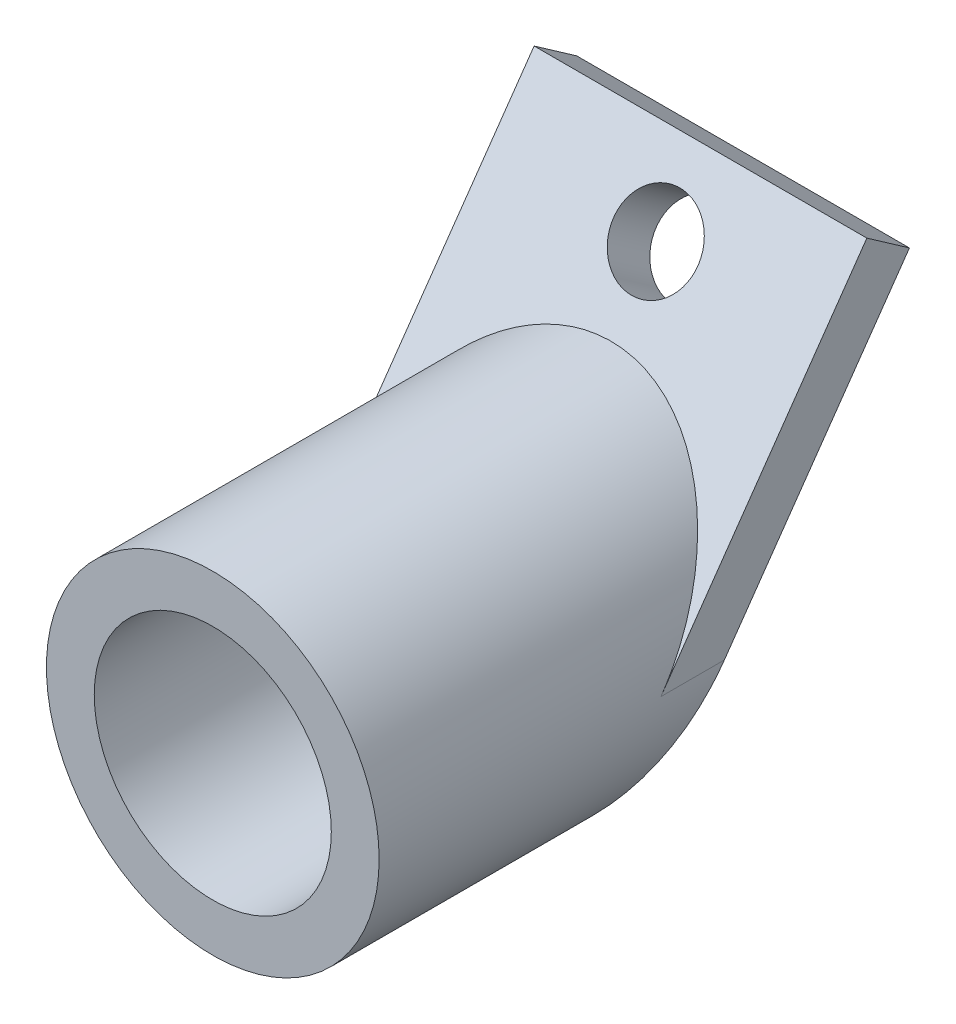
ISO-10303-21;
HEADER;
FILE_DESCRIPTION(('STEP AP214'),'2;1');
FILE_NAME('part.step','',(''),(''),'','','');
FILE_SCHEMA(('AUTOMOTIVE_DESIGN { 1 0 10303 214 1 1 1 1 }'));
ENDSEC;
DATA;
#1=APPLICATION_CONTEXT('core data for automotive mechanical design processes');
#2=APPLICATION_PROTOCOL_DEFINITION('international standard','automotive_design',2000,#1);
#3=PRODUCT_CONTEXT('',#1,'mechanical');
#4=PRODUCT('Part','Part','',(#3));
#5=PRODUCT_RELATED_PRODUCT_CATEGORY('part','',(#4));
#6=PRODUCT_DEFINITION_FORMATION('','',#4);
#7=PRODUCT_DEFINITION_CONTEXT('part definition',#1,'design');
#8=PRODUCT_DEFINITION('design','',#6,#7);
#9=PRODUCT_DEFINITION_SHAPE('','',#8);
#10=(LENGTH_UNIT() NAMED_UNIT(*) SI_UNIT(.MILLI.,.METRE.));
#11=(NAMED_UNIT(*) PLANE_ANGLE_UNIT() SI_UNIT($,.RADIAN.));
#12=(NAMED_UNIT(*) SI_UNIT($,.STERADIAN.) SOLID_ANGLE_UNIT());
#13=UNCERTAINTY_MEASURE_WITH_UNIT(LENGTH_MEASURE(1.E-05),#10,'distance_accuracy_value','');
#14=(GEOMETRIC_REPRESENTATION_CONTEXT(3) GLOBAL_UNCERTAINTY_ASSIGNED_CONTEXT((#13)) GLOBAL_UNIT_ASSIGNED_CONTEXT((#10,
#11,#12)) REPRESENTATION_CONTEXT('',''));
#15=CARTESIAN_POINT('',(0.,0.,0.));
#16=DIRECTION('',(0.,0.,1.));
#17=DIRECTION('',(1.,0.,0.));
#18=AXIS2_PLACEMENT_3D('',#15,#16,#17);
#19=CARTESIAN_POINT('',(16.,16.,-18.3027682789034));
#20=DIRECTION('',(0.,-0.573576436351044,-0.819152044288993));
#21=DIRECTION('',(0.,0.819152044288993,-0.573576436351044));
#22=AXIS2_PLACEMENT_3D('',#19,#20,#21);
#23=PLANE('',#22);
#24=CARTESIAN_POINT('',(0.,22.1436403321675,-22.6045915515363));
#25=DIRECTION('',(0.,0.573576436351044,0.819152044288993));
#26=DIRECTION('',(0.,-0.819152044288993,0.573576436351044));
#27=AXIS2_PLACEMENT_3D('',#24,#25,#26);
#28=CIRCLE('',#27,4.05);
#29=CARTESIAN_POINT('',(0.,18.826074552797,-20.2816069843145));
#30=VERTEX_POINT('',#29);
#31=EDGE_CURVE('E234',#30,#30,#28,.T.);
#32=ORIENTED_EDGE('',*,*,#31,.F.);
#33=EDGE_LOOP('',(#32));
#34=FACE_BOUND('',#33,.T.);
#35=CARTESIAN_POINT('',(0.,0.,-7.09944766754814));
#36=DIRECTION('',(0.,-0.573576436351044,-0.819152044288993));
#37=DIRECTION('',(0.,-0.819152044288993,0.573576436351044));
#38=AXIS2_PLACEMENT_3D('',#35,#36,#37);
#39=ELLIPSE('',#38,19.5323934201833,16.);
#40=CARTESIAN_POINT('',(16.,0.,-7.09944766754815));
#41=VERTEX_POINT('',#40);
#42=CARTESIAN_POINT('',(-16.,0.,-7.09944766754815));
#43=VERTEX_POINT('',#42);
#44=EDGE_CURVE('E83',#41,#43,#39,.F.);
#45=ORIENTED_EDGE('',*,*,#44,.F.);
#46=DIRECTION('',(0.,-0.819152044288994,0.573576436351043));
#47=VECTOR('',#46,1.);
#48=CARTESIAN_POINT('',(16.,16.,-18.3027682789034));
#49=LINE('',#48,#47);
#50=CARTESIAN_POINT('',(16.,28.2872806643349,-26.9064148241691));
#51=VERTEX_POINT('',#50);
#52=EDGE_CURVE('E105',#51,#41,#49,.T.);
#53=ORIENTED_EDGE('',*,*,#52,.F.);
#54=DIRECTION('',(-1.,0.,0.));
#55=VECTOR('',#54,1.);
#56=CARTESIAN_POINT('',(16.,28.2872806643349,-26.9064148241691));
#57=LINE('',#56,#55);
#58=CARTESIAN_POINT('',(-16.,28.2872806643349,-26.9064148241691));
#59=VERTEX_POINT('',#58);
#60=EDGE_CURVE('E107',#51,#59,#57,.T.);
#61=ORIENTED_EDGE('',*,*,#60,.T.);
#62=DIRECTION('',(0.,-0.819152044288994,0.573576436351043));
#63=VECTOR('',#62,1.);
#64=CARTESIAN_POINT('',(-16.,16.,-18.3027682789034));
#65=LINE('',#64,#63);
#66=EDGE_CURVE('E98',#59,#43,#65,.T.);
#67=ORIENTED_EDGE('',*,*,#66,.T.);
#68=EDGE_LOOP('',(#45,#53,#61,#67));
#69=FACE_BOUND('',#68,.T.);
#70=ADVANCED_FACE('F37',(#34,#69),#23,.F.);
#71=CARTESIAN_POINT('',(0.,0.,20.));
#72=DIRECTION('',(0.,0.,1.));
#73=DIRECTION('',(1.,0.,0.));
#74=AXIS2_PLACEMENT_3D('',#71,#72,#73);
#75=PLANE('',#74);
#76=CARTESIAN_POINT('',(0.,0.,20.));
#77=DIRECTION('',(0.,0.,1.));
#78=DIRECTION('',(1.,0.,0.));
#79=AXIS2_PLACEMENT_3D('',#76,#77,#78);
#80=CIRCLE('',#79,16.);
#81=CARTESIAN_POINT('',(16.,0.,20.));
#82=VERTEX_POINT('',#81);
#83=EDGE_CURVE('E46',#82,#82,#80,.T.);
#84=ORIENTED_EDGE('',*,*,#83,.T.);
#85=EDGE_LOOP('',(#84));
#86=FACE_BOUND('',#85,.T.);
#87=CARTESIAN_POINT('',(0.,0.,20.));
#88=DIRECTION('',(0.,0.,1.));
#89=DIRECTION('',(1.,0.,0.));
#90=AXIS2_PLACEMENT_3D('',#87,#88,#89);
#91=CIRCLE('',#90,11.4);
#92=CARTESIAN_POINT('',(11.4,0.,20.));
#93=VERTEX_POINT('',#92);
#94=EDGE_CURVE('E112',#93,#93,#91,.T.);
#95=ORIENTED_EDGE('',*,*,#94,.F.);
#96=EDGE_LOOP('',(#95));
#97=FACE_BOUND('',#96,.T.);
#98=ADVANCED_FACE('F120',(#86,#97),#75,.T.);
#99=CARTESIAN_POINT('',(0.,0.,20.));
#100=DIRECTION('',(0.,0.,-1.));
#101=DIRECTION('',(-1.,0.,0.));
#102=AXIS2_PLACEMENT_3D('',#99,#100,#101);
#103=CYLINDRICAL_SURFACE('',#102,16.);
#104=DIRECTION('',(0.,0.,1.));
#105=VECTOR('',#104,1.);
#106=CARTESIAN_POINT('',(16.,0.,-31.002175045614));
#107=LINE('',#106,#105);
#108=CARTESIAN_POINT('',(16.,0.,-13.2033206113553));
#109=VERTEX_POINT('',#108);
#110=EDGE_CURVE('E91',#109,#41,#107,.T.);
#111=ORIENTED_EDGE('',*,*,#110,.T.);
#112=ORIENTED_EDGE('',*,*,#44,.T.);
#113=DIRECTION('',(0.,0.,-1.));
#114=VECTOR('',#113,1.);
#115=CARTESIAN_POINT('',(-16.,0.,0.));
#116=LINE('',#115,#114);
#117=CARTESIAN_POINT('',(-16.,0.,-13.2033206113553));
#118=VERTEX_POINT('',#117);
#119=EDGE_CURVE('E11',#43,#118,#116,.T.);
#120=ORIENTED_EDGE('',*,*,#119,.T.);
#121=CARTESIAN_POINT('',(0.,0.,-13.2033206113553));
#122=DIRECTION('',(0.,0.573576436351044,0.819152044288994));
#123=DIRECTION('',(0.,-0.819152044288994,0.573576436351044));
#124=AXIS2_PLACEMENT_3D('',#121,#122,#123);
#125=ELLIPSE('',#124,19.5323934201833,16.);
#126=EDGE_CURVE('E81',#109,#118,#125,.F.);
#127=ORIENTED_EDGE('',*,*,#126,.F.);
#128=EDGE_LOOP('',(#111,#112,#120,#127));
#129=FACE_BOUND('',#128,.T.);
#130=ORIENTED_EDGE('',*,*,#83,.F.);
#131=EDGE_LOOP('',(#130));
#132=FACE_BOUND('',#131,.T.);
#133=ADVANCED_FACE('F39',(#129,#132),#103,.T.);
#134=CARTESIAN_POINT('',(0.,0.,20.));
#135=DIRECTION('',(0.,0.,-1.));
#136=DIRECTION('',(-1.,0.,0.));
#137=AXIS2_PLACEMENT_3D('',#134,#135,#136);
#138=CYLINDRICAL_SURFACE('',#137,11.4);
#139=ORIENTED_EDGE('',*,*,#94,.T.);
#140=EDGE_LOOP('',(#139));
#141=FACE_BOUND('',#140,.T.);
#142=CARTESIAN_POINT('',(0.,0.,0.));
#143=DIRECTION('',(0.,0.,1.));
#144=DIRECTION('',(1.,0.,0.));
#145=AXIS2_PLACEMENT_3D('',#142,#143,#144);
#146=CIRCLE('',#145,11.4);
#147=CARTESIAN_POINT('',(11.4,0.,0.));
#148=VERTEX_POINT('',#147);
#149=EDGE_CURVE('E111',#148,#148,#146,.T.);
#150=ORIENTED_EDGE('',*,*,#149,.F.);
#151=EDGE_LOOP('',(#150));
#152=FACE_BOUND('',#151,.T.);
#153=ADVANCED_FACE('F123',(#141,#152),#138,.F.);
#154=CARTESIAN_POINT('',(0.,0.,0.));
#155=DIRECTION('',(0.,0.,-1.));
#156=DIRECTION('',(-1.,0.,0.));
#157=AXIS2_PLACEMENT_3D('',#154,#155,#156);
#158=PLANE('',#157);
#159=ORIENTED_EDGE('',*,*,#149,.T.);
#160=EDGE_LOOP('',(#159));
#161=FACE_BOUND('',#160,.T.);
#162=ADVANCED_FACE('F128',(#161),#158,.F.);
#163=CARTESIAN_POINT('',(16.,25.4193984825797,-31.002175045614));
#164=DIRECTION('',(0.,0.573576436351044,0.819152044288994));
#165=DIRECTION('',(0.,-0.819152044288994,0.573576436351044));
#166=AXIS2_PLACEMENT_3D('',#163,#164,#165);
#167=PLANE('',#166);
#168=CARTESIAN_POINT('',(0.,19.2757581504123,-26.7003517729811));
#169=DIRECTION('',(0.,0.573576436351044,0.819152044288994));
#170=DIRECTION('',(0.,-0.819152044288994,0.573576436351044));
#171=AXIS2_PLACEMENT_3D('',#168,#169,#170);
#172=CIRCLE('',#171,4.05);
#173=CARTESIAN_POINT('',(0.,15.9581923710419,-24.3773672057594));
#174=VERTEX_POINT('',#173);
#175=EDGE_CURVE('E41',#174,#174,#172,.T.);
#176=ORIENTED_EDGE('',*,*,#175,.T.);
#177=EDGE_LOOP('',(#176));
#178=FACE_BOUND('',#177,.T.);
#179=DIRECTION('',(0.,0.819152044288994,-0.573576436351044));
#180=VECTOR('',#179,1.);
#181=CARTESIAN_POINT('',(16.,25.4193984825797,-31.002175045614));
#182=LINE('',#181,#180);
#183=CARTESIAN_POINT('',(16.,25.4193984825797,-31.002175045614));
#184=VERTEX_POINT('',#183);
#185=EDGE_CURVE('E90',#109,#184,#182,.T.);
#186=ORIENTED_EDGE('',*,*,#185,.F.);
#187=ORIENTED_EDGE('',*,*,#126,.T.);
#188=DIRECTION('',(0.,0.819152044288994,-0.573576436351044));
#189=VECTOR('',#188,1.);
#190=CARTESIAN_POINT('',(-16.,25.4193984825797,-31.002175045614));
#191=LINE('',#190,#189);
#192=CARTESIAN_POINT('',(-16.,25.4193984825797,-31.002175045614));
#193=VERTEX_POINT('',#192);
#194=EDGE_CURVE('E88',#118,#193,#191,.T.);
#195=ORIENTED_EDGE('',*,*,#194,.T.);
#196=DIRECTION('',(-1.,0.,0.));
#197=VECTOR('',#196,1.);
#198=CARTESIAN_POINT('',(16.,25.4193984825797,-31.002175045614));
#199=LINE('',#198,#197);
#200=EDGE_CURVE('E109',#184,#193,#199,.T.);
#201=ORIENTED_EDGE('',*,*,#200,.F.);
#202=EDGE_LOOP('',(#186,#187,#195,#201));
#203=FACE_BOUND('',#202,.T.);
#204=ADVANCED_FACE('F86',(#178,#203),#167,.F.);
#205=CARTESIAN_POINT('',(16.,25.4193984825797,-31.002175045614));
#206=DIRECTION('',(0.,-0.819152044288994,0.573576436351042));
#207=DIRECTION('',(0.,-0.573576436351042,-0.819152044288994));
#208=AXIS2_PLACEMENT_3D('',#205,#206,#207);
#209=PLANE('',#208);
#210=ORIENTED_EDGE('',*,*,#200,.T.);
#211=DIRECTION('',(0.,0.573576436351042,0.819152044288994));
#212=VECTOR('',#211,1.);
#213=CARTESIAN_POINT('',(-16.,25.4193984825797,-31.002175045614));
#214=LINE('',#213,#212);
#215=EDGE_CURVE('E96',#193,#59,#214,.T.);
#216=ORIENTED_EDGE('',*,*,#215,.T.);
#217=ORIENTED_EDGE('',*,*,#60,.F.);
#218=DIRECTION('',(0.,0.573576436351042,0.819152044288994));
#219=VECTOR('',#218,1.);
#220=CARTESIAN_POINT('',(16.,25.4193984825797,-31.002175045614));
#221=LINE('',#220,#219);
#222=EDGE_CURVE('E59',#184,#51,#221,.T.);
#223=ORIENTED_EDGE('',*,*,#222,.F.);
#224=EDGE_LOOP('',(#210,#216,#217,#223));
#225=FACE_BOUND('',#224,.T.);
#226=ADVANCED_FACE('F142',(#225),#209,.F.);
#227=CARTESIAN_POINT('',(16.,0.,0.));
#228=DIRECTION('',(-1.,0.,0.));
#229=DIRECTION('',(0.,0.,1.));
#230=AXIS2_PLACEMENT_3D('',#227,#228,#229);
#231=PLANE('',#230);
#232=ORIENTED_EDGE('',*,*,#52,.T.);
#233=ORIENTED_EDGE('',*,*,#110,.F.);
#234=ORIENTED_EDGE('',*,*,#185,.T.);
#235=ORIENTED_EDGE('',*,*,#222,.T.);
#236=EDGE_LOOP('',(#232,#233,#234,#235));
#237=FACE_BOUND('',#236,.T.);
#238=ADVANCED_FACE('F140',(#237),#231,.F.);
#239=CARTESIAN_POINT('',(-16.,0.,0.));
#240=DIRECTION('',(-1.,0.,0.));
#241=DIRECTION('',(0.,0.,1.));
#242=AXIS2_PLACEMENT_3D('',#239,#240,#241);
#243=PLANE('',#242);
#244=ORIENTED_EDGE('',*,*,#119,.F.);
#245=ORIENTED_EDGE('',*,*,#66,.F.);
#246=ORIENTED_EDGE('',*,*,#215,.F.);
#247=ORIENTED_EDGE('',*,*,#194,.F.);
#248=EDGE_LOOP('',(#244,#245,#246,#247));
#249=FACE_BOUND('',#248,.T.);
#250=ADVANCED_FACE('F94',(#249),#243,.T.);
#251=CARTESIAN_POINT('',(0.,5.64919321185999,-46.1611033287167));
#252=DIRECTION('',(0.,0.573576436351044,0.819152044288993));
#253=DIRECTION('',(0.,-0.819152044288993,0.573576436351044));
#254=AXIS2_PLACEMENT_3D('',#251,#252,#253);
#255=CYLINDRICAL_SURFACE('',#254,4.05);
#256=ORIENTED_EDGE('',*,*,#31,.T.);
#257=EDGE_LOOP('',(#256));
#258=FACE_BOUND('',#257,.T.);
#259=ORIENTED_EDGE('',*,*,#175,.F.);
#260=EDGE_LOOP('',(#259));
#261=FACE_BOUND('',#260,.T.);
#262=ADVANCED_FACE('F177',(#258,#261),#255,.F.);
#263=CLOSED_SHELL('',(#70,#98,#133,#153,#162,#204,#226,#238,#250,#262));
#264=MANIFOLD_SOLID_BREP('B2',#263);
#265=ADVANCED_BREP_SHAPE_REPRESENTATION('',(#18,#264),#14);
#266=SHAPE_DEFINITION_REPRESENTATION(#9,#265);
ENDSEC;
END-ISO-10303-21;
